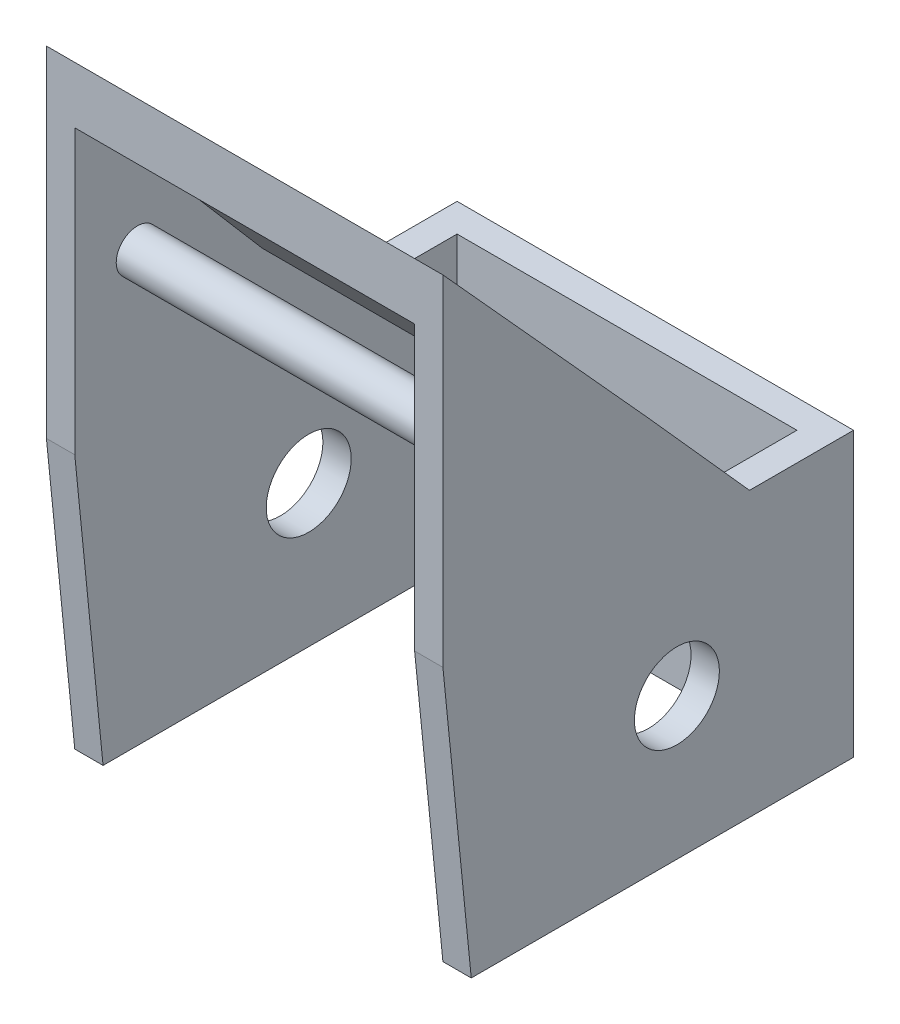
ISO-10303-21;
HEADER;
FILE_DESCRIPTION(('STEP AP214'),'2;1');
FILE_NAME('part.step','',(''),(''),'','','');
FILE_SCHEMA(('AUTOMOTIVE_DESIGN { 1 0 10303 214 1 1 1 1 }'));
ENDSEC;
DATA;
#1=APPLICATION_CONTEXT('core data for automotive mechanical design processes');
#2=APPLICATION_PROTOCOL_DEFINITION('international standard','automotive_design',2000,#1);
#3=PRODUCT_CONTEXT('',#1,'mechanical');
#4=PRODUCT('Part','Part','',(#3));
#5=PRODUCT_RELATED_PRODUCT_CATEGORY('part','',(#4));
#6=PRODUCT_DEFINITION_FORMATION('','',#4);
#7=PRODUCT_DEFINITION_CONTEXT('part definition',#1,'design');
#8=PRODUCT_DEFINITION('design','',#6,#7);
#9=PRODUCT_DEFINITION_SHAPE('','',#8);
#10=(LENGTH_UNIT() NAMED_UNIT(*) SI_UNIT(.MILLI.,.METRE.));
#11=(NAMED_UNIT(*) PLANE_ANGLE_UNIT() SI_UNIT($,.RADIAN.));
#12=(NAMED_UNIT(*) SI_UNIT($,.STERADIAN.) SOLID_ANGLE_UNIT());
#13=UNCERTAINTY_MEASURE_WITH_UNIT(LENGTH_MEASURE(1.E-05),#10,'distance_accuracy_value','');
#14=(GEOMETRIC_REPRESENTATION_CONTEXT(3) GLOBAL_UNCERTAINTY_ASSIGNED_CONTEXT((#13)) GLOBAL_UNIT_ASSIGNED_CONTEXT((#10,
#11,#12)) REPRESENTATION_CONTEXT('',''));
#15=CARTESIAN_POINT('',(0.,0.,0.));
#16=DIRECTION('',(0.,0.,1.));
#17=DIRECTION('',(1.,0.,0.));
#18=AXIS2_PLACEMENT_3D('',#15,#16,#17);
#19=CARTESIAN_POINT('',(70.,70.,70.1575307454289));
#20=DIRECTION('',(0.,0.651008649949704,-0.759070311427514));
#21=DIRECTION('',(0.,0.759070311427514,0.651008649949704));
#22=AXIS2_PLACEMENT_3D('',#19,#20,#21);
#23=PLANE('',#22);
#24=DIRECTION('',(1.,0.,0.));
#25=VECTOR('',#24,1.);
#26=CARTESIAN_POINT('',(0.,80.,78.7339253184877));
#27=LINE('',#26,#25);
#28=CARTESIAN_POINT('',(-60.,80.,78.7339253184877));
#29=VERTEX_POINT('',#28);
#30=CARTESIAN_POINT('',(60.0000000000001,80.,78.7339253184877));
#31=VERTEX_POINT('',#30);
#32=EDGE_CURVE('E180',#29,#31,#27,.T.);
#33=ORIENTED_EDGE('',*,*,#32,.T.);
#34=DIRECTION('',(0.,0.759070311427514,0.651008649949704));
#35=VECTOR('',#34,1.);
#36=CARTESIAN_POINT('',(60.0000000000001,70.,70.1575307454289));
#37=LINE('',#36,#35);
#38=CARTESIAN_POINT('',(60.0000000000001,145.605744001403,135.));
#39=VERTEX_POINT('',#38);
#40=EDGE_CURVE('E166',#31,#39,#37,.T.);
#41=ORIENTED_EDGE('',*,*,#40,.T.);
#42=DIRECTION('',(-1.,0.,0.));
#43=VECTOR('',#42,1.);
#44=CARTESIAN_POINT('',(70.,145.605744001403,135.));
#45=LINE('',#44,#43);
#46=CARTESIAN_POINT('',(-60.,145.605744001403,135.));
#47=VERTEX_POINT('',#46);
#48=EDGE_CURVE('E182',#39,#47,#45,.T.);
#49=ORIENTED_EDGE('',*,*,#48,.T.);
#50=DIRECTION('',(0.,-0.759070311427514,-0.651008649949704));
#51=VECTOR('',#50,1.);
#52=CARTESIAN_POINT('',(-60.,70.,70.1575307454289));
#53=LINE('',#52,#51);
#54=EDGE_CURVE('E178',#47,#29,#53,.T.);
#55=ORIENTED_EDGE('',*,*,#54,.T.);
#56=EDGE_LOOP('',(#33,#41,#49,#55));
#57=FACE_BOUND('',#56,.T.);
#58=ADVANCED_FACE('F33',(#57),#23,.F.);
#59=CARTESIAN_POINT('',(0.,80.,0.));
#60=DIRECTION('',(0.,-1.,0.));
#61=DIRECTION('',(1.,0.,0.));
#62=AXIS2_PLACEMENT_3D('',#59,#60,#61);
#63=PLANE('',#62);
#64=ORIENTED_EDGE('',*,*,#32,.F.);
#65=DIRECTION('',(0.,0.,-1.));
#66=VECTOR('',#65,1.);
#67=CARTESIAN_POINT('',(-60.,80.,145.));
#68=LINE('',#67,#66);
#69=CARTESIAN_POINT('',(-60.,80.,63.5629784970716));
#70=VERTEX_POINT('',#69);
#71=EDGE_CURVE('E48',#29,#70,#68,.T.);
#72=ORIENTED_EDGE('',*,*,#71,.T.);
#73=DIRECTION('',(-1.,0.,0.));
#74=VECTOR('',#73,1.);
#75=CARTESIAN_POINT('',(70.,80.,63.5629784970716));
#76=LINE('',#75,#74);
#77=CARTESIAN_POINT('',(60.,80.,63.5629784970716));
#78=VERTEX_POINT('',#77);
#79=EDGE_CURVE('E187',#78,#70,#76,.T.);
#80=ORIENTED_EDGE('',*,*,#79,.F.);
#81=DIRECTION('',(0.,0.,1.));
#82=VECTOR('',#81,1.);
#83=CARTESIAN_POINT('',(60.,80.,145.));
#84=LINE('',#83,#82);
#85=EDGE_CURVE('E171',#78,#31,#84,.T.);
#86=ORIENTED_EDGE('',*,*,#85,.T.);
#87=EDGE_LOOP('',(#64,#72,#80,#86));
#88=FACE_BOUND('',#87,.T.);
#89=ADVANCED_FACE('F185',(#88),#63,.T.);
#90=CARTESIAN_POINT('',(-70.,50.,10.));
#91=DIRECTION('',(0.,-1.,0.));
#92=DIRECTION('',(0.,0.,-1.));
#93=AXIS2_PLACEMENT_3D('',#90,#91,#92);
#94=PLANE('',#93);
#95=DIRECTION('',(-1.,0.,0.));
#96=VECTOR('',#95,1.);
#97=CARTESIAN_POINT('',(70.,50.,36.7519139882866));
#98=LINE('',#97,#96);
#99=CARTESIAN_POINT('',(70.,50.,36.7519139882866));
#100=VERTEX_POINT('',#99);
#101=CARTESIAN_POINT('',(60.,50.,36.7519139882866));
#102=VERTEX_POINT('',#101);
#103=EDGE_CURVE('E56',#100,#102,#98,.T.);
#104=ORIENTED_EDGE('',*,*,#103,.F.);
#105=DIRECTION('',(0.,0.,-1.));
#106=VECTOR('',#105,1.);
#107=CARTESIAN_POINT('',(70.,50.,10.));
#108=LINE('',#107,#106);
#109=CARTESIAN_POINT('',(70.,50.,0.));
#110=VERTEX_POINT('',#109);
#111=EDGE_CURVE('E298',#100,#110,#108,.T.);
#112=ORIENTED_EDGE('',*,*,#111,.T.);
#113=DIRECTION('',(-1.,0.,0.));
#114=VECTOR('',#113,1.);
#115=CARTESIAN_POINT('',(-70.,50.,0.));
#116=LINE('',#115,#114);
#117=CARTESIAN_POINT('',(-70.,50.,0.));
#118=VERTEX_POINT('',#117);
#119=EDGE_CURVE('E285',#110,#118,#116,.T.);
#120=ORIENTED_EDGE('',*,*,#119,.T.);
#121=DIRECTION('',(0.,0.,-1.));
#122=VECTOR('',#121,1.);
#123=CARTESIAN_POINT('',(-70.,50.,10.));
#124=LINE('',#123,#122);
#125=CARTESIAN_POINT('',(-70.,50.,36.7519139882866));
#126=VERTEX_POINT('',#125);
#127=EDGE_CURVE('E296',#126,#118,#124,.T.);
#128=ORIENTED_EDGE('',*,*,#127,.F.);
#129=CARTESIAN_POINT('',(-60.,50.,36.7519139882866));
#130=VERTEX_POINT('',#129);
#131=EDGE_CURVE('E231',#130,#126,#98,.T.);
#132=ORIENTED_EDGE('',*,*,#131,.F.);
#133=DIRECTION('',(0.,0.,-1.));
#134=VECTOR('',#133,1.);
#135=CARTESIAN_POINT('',(-60.,50.,130.));
#136=LINE('',#135,#134);
#137=CARTESIAN_POINT('',(-60.,50.,10.));
#138=VERTEX_POINT('',#137);
#139=EDGE_CURVE('E260',#130,#138,#136,.T.);
#140=ORIENTED_EDGE('',*,*,#139,.T.);
#141=DIRECTION('',(-1.,0.,0.));
#142=VECTOR('',#141,1.);
#143=CARTESIAN_POINT('',(-70.,50.,10.));
#144=LINE('',#143,#142);
#145=CARTESIAN_POINT('',(60.0000000000001,50.,10.));
#146=VERTEX_POINT('',#145);
#147=EDGE_CURVE('E276',#146,#138,#144,.T.);
#148=ORIENTED_EDGE('',*,*,#147,.F.);
#149=DIRECTION('',(0.,0.,-1.));
#150=VECTOR('',#149,1.);
#151=CARTESIAN_POINT('',(60.,50.,130.));
#152=LINE('',#151,#150);
#153=EDGE_CURVE('E272',#102,#146,#152,.T.);
#154=ORIENTED_EDGE('',*,*,#153,.F.);
#155=EDGE_LOOP('',(#104,#112,#120,#128,#132,#140,#148,#154));
#156=FACE_BOUND('',#155,.T.);
#157=ADVANCED_FACE('F342',(#156),#94,.F.);
#158=CARTESIAN_POINT('',(0.,0.,10.));
#159=DIRECTION('',(0.,0.,1.));
#160=DIRECTION('',(1.,0.,0.));
#161=AXIS2_PLACEMENT_3D('',#158,#159,#160);
#162=PLANE('',#161);
#163=CARTESIAN_POINT('',(0.,0.,10.));
#164=DIRECTION('',(0.,0.,1.));
#165=DIRECTION('',(1.,0.,0.));
#166=AXIS2_PLACEMENT_3D('',#163,#164,#165);
#167=CIRCLE('',#166,15.);
#168=CARTESIAN_POINT('',(15.,0.,10.));
#169=VERTEX_POINT('',#168);
#170=EDGE_CURVE('E308',#169,#169,#167,.T.);
#171=ORIENTED_EDGE('',*,*,#170,.F.);
#172=EDGE_LOOP('',(#171));
#173=FACE_BOUND('',#172,.T.);
#174=ORIENTED_EDGE('',*,*,#147,.T.);
#175=DIRECTION('',(0.,1.,0.));
#176=VECTOR('',#175,1.);
#177=CARTESIAN_POINT('',(-60.,50.,10.));
#178=LINE('',#177,#176);
#179=CARTESIAN_POINT('',(-60.,-50.,10.));
#180=VERTEX_POINT('',#179);
#181=EDGE_CURVE('E255',#180,#138,#178,.T.);
#182=ORIENTED_EDGE('',*,*,#181,.F.);
#183=DIRECTION('',(1.,0.,0.));
#184=VECTOR('',#183,1.);
#185=CARTESIAN_POINT('',(-70.,-50.,10.));
#186=LINE('',#185,#184);
#187=CARTESIAN_POINT('',(60.0000000000001,-50.,10.));
#188=VERTEX_POINT('',#187);
#189=EDGE_CURVE('E279',#180,#188,#186,.T.);
#190=ORIENTED_EDGE('',*,*,#189,.T.);
#191=DIRECTION('',(0.,-1.,0.));
#192=VECTOR('',#191,1.);
#193=CARTESIAN_POINT('',(60.,50.,10.));
#194=LINE('',#193,#192);
#195=EDGE_CURVE('E266',#146,#188,#194,.T.);
#196=ORIENTED_EDGE('',*,*,#195,.F.);
#197=EDGE_LOOP('',(#174,#182,#190,#196));
#198=FACE_BOUND('',#197,.T.);
#199=ADVANCED_FACE('F346',(#173,#198),#162,.T.);
#200=CARTESIAN_POINT('',(70.,50.,10.));
#201=DIRECTION('',(-1.,0.,0.));
#202=DIRECTION('',(0.,-1.,0.));
#203=AXIS2_PLACEMENT_3D('',#200,#201,#202);
#204=PLANE('',#203);
#205=CARTESIAN_POINT('',(70.,0.,62.3874398391209));
#206=DIRECTION('',(-1.,0.,0.));
#207=DIRECTION('',(0.,-1.,0.));
#208=AXIS2_PLACEMENT_3D('',#205,#206,#207);
#209=CIRCLE('',#208,15.);
#210=CARTESIAN_POINT('',(70.,-15.,62.3874398391209));
#211=VERTEX_POINT('',#210);
#212=EDGE_CURVE('E198',#211,#211,#209,.T.);
#213=ORIENTED_EDGE('',*,*,#212,.T.);
#214=EDGE_LOOP('',(#213));
#215=FACE_BOUND('',#214,.T.);
#216=DIRECTION('',(0.,1.,0.));
#217=VECTOR('',#216,1.);
#218=CARTESIAN_POINT('',(70.,50.,0.));
#219=LINE('',#218,#217);
#220=CARTESIAN_POINT('',(70.,-50.,0.));
#221=VERTEX_POINT('',#220);
#222=EDGE_CURVE('E275',#221,#110,#219,.T.);
#223=ORIENTED_EDGE('',*,*,#222,.T.);
#224=ORIENTED_EDGE('',*,*,#111,.F.);
#225=DIRECTION('',(0.,-0.74562456234441,-0.666366274678354));
#226=VECTOR('',#225,1.);
#227=CARTESIAN_POINT('',(70.,90.,72.5));
#228=LINE('',#227,#226);
#229=CARTESIAN_POINT('',(70.,90.,72.5));
#230=VERTEX_POINT('',#229);
#231=EDGE_CURVE('E217',#230,#100,#228,.T.);
#232=ORIENTED_EDGE('',*,*,#231,.F.);
#233=DIRECTION('',(0.,-0.740986951435983,-0.671519424738859));
#234=VECTOR('',#233,1.);
#235=CARTESIAN_POINT('',(70.,90.,72.5));
#236=LINE('',#235,#234);
#237=CARTESIAN_POINT('',(70.,170.,145.));
#238=VERTEX_POINT('',#237);
#239=EDGE_CURVE('E213',#238,#230,#236,.T.);
#240=ORIENTED_EDGE('',*,*,#239,.F.);
#241=DIRECTION('',(0.,1.,0.));
#242=VECTOR('',#241,1.);
#243=CARTESIAN_POINT('',(70.,170.,145.));
#244=LINE('',#243,#242);
#245=CARTESIAN_POINT('',(70.,50.,145.));
#246=VERTEX_POINT('',#245);
#247=EDGE_CURVE('E210',#246,#238,#244,.T.);
#248=ORIENTED_EDGE('',*,*,#247,.F.);
#249=DIRECTION('',(0.,-0.995037190209989,-0.0995037190209987));
#250=VECTOR('',#249,1.);
#251=CARTESIAN_POINT('',(70.,50.,145.));
#252=LINE('',#251,#250);
#253=CARTESIAN_POINT('',(70.,-50.,135.));
#254=VERTEX_POINT('',#253);
#255=EDGE_CURVE('E229',#246,#254,#252,.T.);
#256=ORIENTED_EDGE('',*,*,#255,.T.);
#257=DIRECTION('',(0.,0.,-1.));
#258=VECTOR('',#257,1.);
#259=CARTESIAN_POINT('',(70.,-50.,10.));
#260=LINE('',#259,#258);
#261=EDGE_CURVE('E282',#254,#221,#260,.T.);
#262=ORIENTED_EDGE('',*,*,#261,.T.);
#263=EDGE_LOOP('',(#223,#224,#232,#240,#248,#256,#262));
#264=FACE_BOUND('',#263,.T.);
#265=ADVANCED_FACE('F35',(#215,#264),#204,.F.);
#266=CARTESIAN_POINT('',(-70.,50.,10.));
#267=DIRECTION('',(1.,0.,0.));
#268=DIRECTION('',(0.,1.,0.));
#269=AXIS2_PLACEMENT_3D('',#266,#267,#268);
#270=PLANE('',#269);
#271=CARTESIAN_POINT('',(-70.,0.,62.3874398391209));
#272=DIRECTION('',(-1.,0.,0.));
#273=DIRECTION('',(0.,-1.,0.));
#274=AXIS2_PLACEMENT_3D('',#271,#272,#273);
#275=CIRCLE('',#274,15.);
#276=CARTESIAN_POINT('',(-70.,-15.,62.3874398391209));
#277=VERTEX_POINT('',#276);
#278=EDGE_CURVE('E305',#277,#277,#275,.T.);
#279=ORIENTED_EDGE('',*,*,#278,.F.);
#280=EDGE_LOOP('',(#279));
#281=FACE_BOUND('',#280,.T.);
#282=DIRECTION('',(0.,-1.,0.));
#283=VECTOR('',#282,1.);
#284=CARTESIAN_POINT('',(-70.,50.,0.));
#285=LINE('',#284,#283);
#286=CARTESIAN_POINT('',(-70.,-50.,0.));
#287=VERTEX_POINT('',#286);
#288=EDGE_CURVE('E288',#118,#287,#285,.T.);
#289=ORIENTED_EDGE('',*,*,#288,.T.);
#290=DIRECTION('',(0.,0.,-1.));
#291=VECTOR('',#290,1.);
#292=CARTESIAN_POINT('',(-70.,-50.,10.));
#293=LINE('',#292,#291);
#294=CARTESIAN_POINT('',(-70.,-50.,135.));
#295=VERTEX_POINT('',#294);
#296=EDGE_CURVE('E293',#295,#287,#293,.T.);
#297=ORIENTED_EDGE('',*,*,#296,.F.);
#298=DIRECTION('',(0.,0.995037190209989,0.0995037190209987));
#299=VECTOR('',#298,1.);
#300=CARTESIAN_POINT('',(-70.,50.,145.));
#301=LINE('',#300,#299);
#302=CARTESIAN_POINT('',(-70.,50.,145.));
#303=VERTEX_POINT('',#302);
#304=EDGE_CURVE('E244',#295,#303,#301,.T.);
#305=ORIENTED_EDGE('',*,*,#304,.T.);
#306=DIRECTION('',(0.,1.,0.));
#307=VECTOR('',#306,1.);
#308=CARTESIAN_POINT('',(-70.,170.,145.));
#309=LINE('',#308,#307);
#310=CARTESIAN_POINT('',(-70.,170.,145.));
#311=VERTEX_POINT('',#310);
#312=EDGE_CURVE('E209',#303,#311,#309,.T.);
#313=ORIENTED_EDGE('',*,*,#312,.T.);
#314=DIRECTION('',(0.,-0.740986951435983,-0.671519424738859));
#315=VECTOR('',#314,1.);
#316=CARTESIAN_POINT('',(-70.,90.,72.5));
#317=LINE('',#316,#315);
#318=CARTESIAN_POINT('',(-70.,90.,72.5));
#319=VERTEX_POINT('',#318);
#320=EDGE_CURVE('E223',#311,#319,#317,.T.);
#321=ORIENTED_EDGE('',*,*,#320,.T.);
#322=DIRECTION('',(0.,-0.74562456234441,-0.666366274678354));
#323=VECTOR('',#322,1.);
#324=CARTESIAN_POINT('',(-70.,90.,72.5));
#325=LINE('',#324,#323);
#326=EDGE_CURVE('E214',#319,#126,#325,.T.);
#327=ORIENTED_EDGE('',*,*,#326,.T.);
#328=ORIENTED_EDGE('',*,*,#127,.T.);
#329=EDGE_LOOP('',(#289,#297,#305,#313,#321,#327,#328));
#330=FACE_BOUND('',#329,.T.);
#331=ADVANCED_FACE('F357',(#281,#330),#270,.F.);
#332=CARTESIAN_POINT('',(-70.,-50.,10.));
#333=DIRECTION('',(0.,1.,0.));
#334=DIRECTION('',(0.,0.,1.));
#335=AXIS2_PLACEMENT_3D('',#332,#333,#334);
#336=PLANE('',#335);
#337=DIRECTION('',(1.,0.,0.));
#338=VECTOR('',#337,1.);
#339=CARTESIAN_POINT('',(-70.,-50.,0.));
#340=LINE('',#339,#338);
#341=EDGE_CURVE('E280',#287,#221,#340,.T.);
#342=ORIENTED_EDGE('',*,*,#341,.T.);
#343=ORIENTED_EDGE('',*,*,#261,.F.);
#344=DIRECTION('',(1.,0.,0.));
#345=VECTOR('',#344,1.);
#346=CARTESIAN_POINT('',(60.0000000000001,-50.,135.));
#347=LINE('',#346,#345);
#348=CARTESIAN_POINT('',(60.0000000000001,-50.,135.));
#349=VERTEX_POINT('',#348);
#350=EDGE_CURVE('E241',#349,#254,#347,.T.);
#351=ORIENTED_EDGE('',*,*,#350,.F.);
#352=DIRECTION('',(0.,0.,-1.));
#353=VECTOR('',#352,1.);
#354=CARTESIAN_POINT('',(60.0000000000001,-50.,130.));
#355=LINE('',#354,#353);
#356=EDGE_CURVE('E269',#349,#188,#355,.T.);
#357=ORIENTED_EDGE('',*,*,#356,.T.);
#358=ORIENTED_EDGE('',*,*,#189,.F.);
#359=DIRECTION('',(0.,0.,-1.));
#360=VECTOR('',#359,1.);
#361=CARTESIAN_POINT('',(-60.,-50.,130.));
#362=LINE('',#361,#360);
#363=CARTESIAN_POINT('',(-60.,-50.,135.));
#364=VERTEX_POINT('',#363);
#365=EDGE_CURVE('E263',#364,#180,#362,.T.);
#366=ORIENTED_EDGE('',*,*,#365,.F.);
#367=DIRECTION('',(-1.,0.,0.));
#368=VECTOR('',#367,1.);
#369=CARTESIAN_POINT('',(-60.,-50.,135.));
#370=LINE('',#369,#368);
#371=EDGE_CURVE('E250',#364,#295,#370,.T.);
#372=ORIENTED_EDGE('',*,*,#371,.T.);
#373=ORIENTED_EDGE('',*,*,#296,.T.);
#374=EDGE_LOOP('',(#342,#343,#351,#357,#358,#366,#372,#373));
#375=FACE_BOUND('',#374,.T.);
#376=ADVANCED_FACE('F351',(#375),#336,.F.);
#377=CARTESIAN_POINT('',(0.,0.,0.));
#378=DIRECTION('',(0.,0.,1.));
#379=DIRECTION('',(1.,0.,0.));
#380=AXIS2_PLACEMENT_3D('',#377,#378,#379);
#381=PLANE('',#380);
#382=CARTESIAN_POINT('',(0.,0.,0.));
#383=DIRECTION('',(0.,0.,1.));
#384=DIRECTION('',(1.,0.,0.));
#385=AXIS2_PLACEMENT_3D('',#382,#383,#384);
#386=CIRCLE('',#385,15.);
#387=CARTESIAN_POINT('',(15.,0.,0.));
#388=VERTEX_POINT('',#387);
#389=EDGE_CURVE('E306',#388,#388,#386,.T.);
#390=ORIENTED_EDGE('',*,*,#389,.T.);
#391=EDGE_LOOP('',(#390));
#392=FACE_BOUND('',#391,.T.);
#393=ORIENTED_EDGE('',*,*,#222,.F.);
#394=ORIENTED_EDGE('',*,*,#341,.F.);
#395=ORIENTED_EDGE('',*,*,#288,.F.);
#396=ORIENTED_EDGE('',*,*,#119,.F.);
#397=EDGE_LOOP('',(#393,#394,#395,#396));
#398=FACE_BOUND('',#397,.T.);
#399=ADVANCED_FACE('F372',(#392,#398),#381,.F.);
#400=CARTESIAN_POINT('',(60.,50.,130.));
#401=DIRECTION('',(1.,0.,0.));
#402=DIRECTION('',(0.,1.,0.));
#403=AXIS2_PLACEMENT_3D('',#400,#401,#402);
#404=PLANE('',#403);
#405=CARTESIAN_POINT('',(60.,101.432424940226,122.863088973279));
#406=DIRECTION('',(1.,0.,0.));
#407=DIRECTION('',(0.,1.,0.));
#408=AXIS2_PLACEMENT_3D('',#405,#406,#407);
#409=CIRCLE('',#408,7.50000000000001);
#410=CARTESIAN_POINT('',(60.,108.932424940227,122.863088973279));
#411=VERTEX_POINT('',#410);
#412=EDGE_CURVE('E11',#411,#411,#409,.F.);
#413=ORIENTED_EDGE('',*,*,#412,.F.);
#414=EDGE_LOOP('',(#413));
#415=FACE_BOUND('',#414,.T.);
#416=ORIENTED_EDGE('',*,*,#40,.F.);
#417=ORIENTED_EDGE('',*,*,#85,.F.);
#418=DIRECTION('',(0.,-0.74562456234441,-0.666366274678354));
#419=VECTOR('',#418,1.);
#420=CARTESIAN_POINT('',(60.,90.,72.5));
#421=LINE('',#420,#419);
#422=CARTESIAN_POINT('',(60.,60.9064439346687,46.4990263847482));
#423=VERTEX_POINT('',#422);
#424=EDGE_CURVE('E205',#78,#423,#421,.T.);
#425=ORIENTED_EDGE('',*,*,#424,.T.);
#426=DIRECTION('',(0.,-1.,0.));
#427=VECTOR('',#426,1.);
#428=CARTESIAN_POINT('',(60.,80.,46.4990263847482));
#429=LINE('',#428,#427);
#430=CARTESIAN_POINT('',(60.,50.,46.4990263847482));
#431=VERTEX_POINT('',#430);
#432=EDGE_CURVE('E190',#423,#431,#429,.T.);
#433=ORIENTED_EDGE('',*,*,#432,.T.);
#434=EDGE_CURVE('E273',#431,#102,#152,.T.);
#435=ORIENTED_EDGE('',*,*,#434,.T.);
#436=ORIENTED_EDGE('',*,*,#153,.T.);
#437=ORIENTED_EDGE('',*,*,#195,.T.);
#438=ORIENTED_EDGE('',*,*,#356,.F.);
#439=DIRECTION('',(0.,-0.995037190209989,-0.0995037190209987));
#440=VECTOR('',#439,1.);
#441=CARTESIAN_POINT('',(60.,50.,145.));
#442=LINE('',#441,#440);
#443=CARTESIAN_POINT('',(60.,50.,145.));
#444=VERTEX_POINT('',#443);
#445=EDGE_CURVE('E235',#444,#349,#442,.T.);
#446=ORIENTED_EDGE('',*,*,#445,.F.);
#447=DIRECTION('',(0.,-1.,0.));
#448=VECTOR('',#447,1.);
#449=CARTESIAN_POINT('',(60.,80.,145.));
#450=LINE('',#449,#448);
#451=CARTESIAN_POINT('',(60.,150.,145.));
#452=VERTEX_POINT('',#451);
#453=EDGE_CURVE('E201',#452,#444,#450,.T.);
#454=ORIENTED_EDGE('',*,*,#453,.F.);
#455=DIRECTION('',(0.,0.,1.));
#456=VECTOR('',#455,1.);
#457=CARTESIAN_POINT('',(60.,150.,135.));
#458=LINE('',#457,#456);
#459=CARTESIAN_POINT('',(60.,150.,135.));
#460=VERTEX_POINT('',#459);
#461=EDGE_CURVE('E381',#460,#452,#458,.T.);
#462=ORIENTED_EDGE('',*,*,#461,.F.);
#463=DIRECTION('',(0.,1.,0.));
#464=VECTOR('',#463,1.);
#465=CARTESIAN_POINT('',(60.,80.,135.));
#466=LINE('',#465,#464);
#467=EDGE_CURVE('E174',#39,#460,#466,.T.);
#468=ORIENTED_EDGE('',*,*,#467,.F.);
#469=EDGE_LOOP('',(#416,#417,#425,#433,#435,#436,#437,#438,#446,#454,#462,#468));
#470=FACE_BOUND('',#469,.T.);
#471=CARTESIAN_POINT('',(60.,0.,62.3874398391209));
#472=DIRECTION('',(1.,0.,0.));
#473=DIRECTION('',(0.,1.,0.));
#474=AXIS2_PLACEMENT_3D('',#471,#472,#473);
#475=CIRCLE('',#474,15.);
#476=CARTESIAN_POINT('',(60.,15.,62.3874398391209));
#477=VERTEX_POINT('',#476);
#478=EDGE_CURVE('E304',#477,#477,#475,.T.);
#479=ORIENTED_EDGE('',*,*,#478,.T.);
#480=EDGE_LOOP('',(#479));
#481=FACE_BOUND('',#480,.T.);
#482=ADVANCED_FACE('F168',(#415,#470,#481),#404,.F.);
#483=CARTESIAN_POINT('',(-60.,50.,130.));
#484=DIRECTION('',(-1.,0.,0.));
#485=DIRECTION('',(0.,-1.,0.));
#486=AXIS2_PLACEMENT_3D('',#483,#484,#485);
#487=PLANE('',#486);
#488=CARTESIAN_POINT('',(-60.,101.432424940226,122.863088973279));
#489=DIRECTION('',(-1.,0.,0.));
#490=DIRECTION('',(0.,-1.,0.));
#491=AXIS2_PLACEMENT_3D('',#488,#489,#490);
#492=CIRCLE('',#491,7.50000000000001);
#493=CARTESIAN_POINT('',(-60.,93.9324249402265,122.863088973279));
#494=VERTEX_POINT('',#493);
#495=EDGE_CURVE('E41',#494,#494,#492,.F.);
#496=ORIENTED_EDGE('',*,*,#495,.F.);
#497=EDGE_LOOP('',(#496));
#498=FACE_BOUND('',#497,.T.);
#499=CARTESIAN_POINT('',(-60.,0.,62.3874398391209));
#500=DIRECTION('',(-1.,0.,0.));
#501=DIRECTION('',(0.,-1.,0.));
#502=AXIS2_PLACEMENT_3D('',#499,#500,#501);
#503=CIRCLE('',#502,15.);
#504=CARTESIAN_POINT('',(-60.,-15.,62.3874398391209));
#505=VERTEX_POINT('',#504);
#506=EDGE_CURVE('E301',#505,#505,#503,.T.);
#507=ORIENTED_EDGE('',*,*,#506,.T.);
#508=EDGE_LOOP('',(#507));
#509=FACE_BOUND('',#508,.T.);
#510=ORIENTED_EDGE('',*,*,#71,.F.);
#511=ORIENTED_EDGE('',*,*,#54,.F.);
#512=DIRECTION('',(0.,-1.,0.));
#513=VECTOR('',#512,1.);
#514=CARTESIAN_POINT('',(-60.,80.,135.));
#515=LINE('',#514,#513);
#516=CARTESIAN_POINT('',(-60.,150.,135.));
#517=VERTEX_POINT('',#516);
#518=EDGE_CURVE('E393',#517,#47,#515,.T.);
#519=ORIENTED_EDGE('',*,*,#518,.F.);
#520=DIRECTION('',(0.,0.,1.));
#521=VECTOR('',#520,1.);
#522=CARTESIAN_POINT('',(-60.,150.,135.));
#523=LINE('',#522,#521);
#524=CARTESIAN_POINT('',(-60.,150.,145.));
#525=VERTEX_POINT('',#524);
#526=EDGE_CURVE('E390',#517,#525,#523,.T.);
#527=ORIENTED_EDGE('',*,*,#526,.T.);
#528=DIRECTION('',(0.,-1.,0.));
#529=VECTOR('',#528,1.);
#530=CARTESIAN_POINT('',(-60.,80.,145.));
#531=LINE('',#530,#529);
#532=CARTESIAN_POINT('',(-60.,50.,145.));
#533=VERTEX_POINT('',#532);
#534=EDGE_CURVE('E199',#525,#533,#531,.T.);
#535=ORIENTED_EDGE('',*,*,#534,.T.);
#536=DIRECTION('',(0.,0.995037190209989,0.0995037190209987));
#537=VECTOR('',#536,1.);
#538=CARTESIAN_POINT('',(-60.,50.,145.));
#539=LINE('',#538,#537);
#540=EDGE_CURVE('E247',#364,#533,#539,.T.);
#541=ORIENTED_EDGE('',*,*,#540,.F.);
#542=ORIENTED_EDGE('',*,*,#365,.T.);
#543=ORIENTED_EDGE('',*,*,#181,.T.);
#544=ORIENTED_EDGE('',*,*,#139,.F.);
#545=CARTESIAN_POINT('',(-60.,50.,46.4990263847482));
#546=VERTEX_POINT('',#545);
#547=EDGE_CURVE('E261',#546,#130,#136,.T.);
#548=ORIENTED_EDGE('',*,*,#547,.F.);
#549=DIRECTION('',(0.,-1.,0.));
#550=VECTOR('',#549,1.);
#551=CARTESIAN_POINT('',(-60.,80.,46.4990263847482));
#552=LINE('',#551,#550);
#553=CARTESIAN_POINT('',(-60.,60.9064439346687,46.4990263847482));
#554=VERTEX_POINT('',#553);
#555=EDGE_CURVE('E188',#554,#546,#552,.T.);
#556=ORIENTED_EDGE('',*,*,#555,.F.);
#557=DIRECTION('',(0.,0.74562456234441,0.666366274678354));
#558=VECTOR('',#557,1.);
#559=CARTESIAN_POINT('',(-60.,90.,72.5));
#560=LINE('',#559,#558);
#561=EDGE_CURVE('E207',#554,#70,#560,.T.);
#562=ORIENTED_EDGE('',*,*,#561,.T.);
#563=EDGE_LOOP('',(#510,#511,#519,#527,#535,#541,#542,#543,#544,#548,#556,#562));
#564=FACE_BOUND('',#563,.T.);
#565=ADVANCED_FACE('F316',(#498,#509,#564),#487,.F.);
#566=CARTESIAN_POINT('',(-60.,50.,145.));
#567=DIRECTION('',(0.,-0.0995037190209987,0.995037190209989));
#568=DIRECTION('',(0.,-0.995037190209989,-0.0995037190209987));
#569=AXIS2_PLACEMENT_3D('',#566,#567,#568);
#570=PLANE('',#569);
#571=ORIENTED_EDGE('',*,*,#304,.F.);
#572=ORIENTED_EDGE('',*,*,#371,.F.);
#573=ORIENTED_EDGE('',*,*,#540,.T.);
#574=DIRECTION('',(-1.,0.,0.));
#575=VECTOR('',#574,1.);
#576=CARTESIAN_POINT('',(-60.,50.,145.));
#577=LINE('',#576,#575);
#578=EDGE_CURVE('E253',#533,#303,#577,.T.);
#579=ORIENTED_EDGE('',*,*,#578,.T.);
#580=EDGE_LOOP('',(#571,#572,#573,#579));
#581=FACE_BOUND('',#580,.T.);
#582=ADVANCED_FACE('F319',(#581),#570,.T.);
#583=CARTESIAN_POINT('',(60.,50.,145.));
#584=DIRECTION('',(0.,-0.0995037190209987,0.995037190209989));
#585=DIRECTION('',(0.,-0.995037190209989,-0.0995037190209987));
#586=AXIS2_PLACEMENT_3D('',#583,#584,#585);
#587=PLANE('',#586);
#588=ORIENTED_EDGE('',*,*,#255,.F.);
#589=DIRECTION('',(1.,0.,0.));
#590=VECTOR('',#589,1.);
#591=CARTESIAN_POINT('',(60.,50.,145.));
#592=LINE('',#591,#590);
#593=EDGE_CURVE('E238',#444,#246,#592,.T.);
#594=ORIENTED_EDGE('',*,*,#593,.F.);
#595=ORIENTED_EDGE('',*,*,#445,.T.);
#596=ORIENTED_EDGE('',*,*,#350,.T.);
#597=EDGE_LOOP('',(#588,#594,#595,#596));
#598=FACE_BOUND('',#597,.T.);
#599=ADVANCED_FACE('F377',(#598),#587,.T.);
#600=CARTESIAN_POINT('',(70.,50.,145.));
#601=DIRECTION('',(0.,-1.,0.));
#602=DIRECTION('',(1.,0.,0.));
#603=AXIS2_PLACEMENT_3D('',#600,#601,#602);
#604=PLANE('',#603);
#605=DIRECTION('',(1.,0.,0.));
#606=VECTOR('',#605,1.);
#607=CARTESIAN_POINT('',(-60.,50.,46.4990263847482));
#608=LINE('',#607,#606);
#609=EDGE_CURVE('E192',#546,#431,#608,.T.);
#610=ORIENTED_EDGE('',*,*,#609,.F.);
#611=ORIENTED_EDGE('',*,*,#547,.T.);
#612=EDGE_CURVE('E230',#102,#130,#98,.T.);
#613=ORIENTED_EDGE('',*,*,#612,.F.);
#614=ORIENTED_EDGE('',*,*,#434,.F.);
#615=EDGE_LOOP('',(#610,#611,#613,#614));
#616=FACE_BOUND('',#615,.T.);
#617=ADVANCED_FACE('F338',(#616),#604,.T.);
#618=CARTESIAN_POINT('',(70.,90.,72.5));
#619=DIRECTION('',(0.,0.666366274678354,-0.74562456234441));
#620=DIRECTION('',(0.,0.74562456234441,0.666366274678354));
#621=AXIS2_PLACEMENT_3D('',#618,#619,#620);
#622=PLANE('',#621);
#623=DIRECTION('',(-1.,0.,0.));
#624=VECTOR('',#623,1.);
#625=CARTESIAN_POINT('',(70.,60.9064439346687,46.4990263847482));
#626=LINE('',#625,#624);
#627=EDGE_CURVE('E183',#423,#554,#626,.T.);
#628=ORIENTED_EDGE('',*,*,#627,.F.);
#629=ORIENTED_EDGE('',*,*,#424,.F.);
#630=ORIENTED_EDGE('',*,*,#79,.T.);
#631=ORIENTED_EDGE('',*,*,#561,.F.);
#632=EDGE_LOOP('',(#628,#629,#630,#631));
#633=FACE_BOUND('',#632,.T.);
#634=ORIENTED_EDGE('',*,*,#326,.F.);
#635=DIRECTION('',(-1.,0.,0.));
#636=VECTOR('',#635,1.);
#637=CARTESIAN_POINT('',(70.,90.,72.5));
#638=LINE('',#637,#636);
#639=EDGE_CURVE('E232',#230,#319,#638,.T.);
#640=ORIENTED_EDGE('',*,*,#639,.F.);
#641=ORIENTED_EDGE('',*,*,#231,.T.);
#642=ORIENTED_EDGE('',*,*,#103,.T.);
#643=ORIENTED_EDGE('',*,*,#612,.T.);
#644=ORIENTED_EDGE('',*,*,#131,.T.);
#645=EDGE_LOOP('',(#634,#640,#641,#642,#643,#644));
#646=FACE_BOUND('',#645,.T.);
#647=ADVANCED_FACE('F329',(#633,#646),#622,.T.);
#648=CARTESIAN_POINT('',(70.,90.,72.5));
#649=DIRECTION('',(0.,0.671519424738859,-0.740986951435983));
#650=DIRECTION('',(0.,0.740986951435983,0.671519424738859));
#651=AXIS2_PLACEMENT_3D('',#648,#649,#650);
#652=PLANE('',#651);
#653=ORIENTED_EDGE('',*,*,#320,.F.);
#654=DIRECTION('',(-1.,0.,0.));
#655=VECTOR('',#654,1.);
#656=CARTESIAN_POINT('',(70.,170.,145.));
#657=LINE('',#656,#655);
#658=EDGE_CURVE('E220',#238,#311,#657,.T.);
#659=ORIENTED_EDGE('',*,*,#658,.F.);
#660=ORIENTED_EDGE('',*,*,#239,.T.);
#661=ORIENTED_EDGE('',*,*,#639,.T.);
#662=EDGE_LOOP('',(#653,#659,#660,#661));
#663=FACE_BOUND('',#662,.T.);
#664=ADVANCED_FACE('F364',(#663),#652,.T.);
#665=CARTESIAN_POINT('',(70.,170.,145.));
#666=DIRECTION('',(0.,0.,1.));
#667=DIRECTION('',(0.,-1.,0.));
#668=AXIS2_PLACEMENT_3D('',#665,#666,#667);
#669=PLANE('',#668);
#670=ORIENTED_EDGE('',*,*,#534,.F.);
#671=DIRECTION('',(-1.,0.,0.));
#672=VECTOR('',#671,1.);
#673=CARTESIAN_POINT('',(-60.,150.,145.));
#674=LINE('',#673,#672);
#675=EDGE_CURVE('E387',#452,#525,#674,.T.);
#676=ORIENTED_EDGE('',*,*,#675,.F.);
#677=ORIENTED_EDGE('',*,*,#453,.T.);
#678=ORIENTED_EDGE('',*,*,#593,.T.);
#679=ORIENTED_EDGE('',*,*,#247,.T.);
#680=ORIENTED_EDGE('',*,*,#658,.T.);
#681=ORIENTED_EDGE('',*,*,#312,.F.);
#682=ORIENTED_EDGE('',*,*,#578,.F.);
#683=EDGE_LOOP('',(#670,#676,#677,#678,#679,#680,#681,#682));
#684=FACE_BOUND('',#683,.T.);
#685=ADVANCED_FACE('F359',(#684),#669,.T.);
#686=CARTESIAN_POINT('',(-60.,80.,46.4990263847482));
#687=DIRECTION('',(0.,0.,-1.));
#688=DIRECTION('',(-1.,0.,0.));
#689=AXIS2_PLACEMENT_3D('',#686,#687,#688);
#690=PLANE('',#689);
#691=ORIENTED_EDGE('',*,*,#627,.T.);
#692=ORIENTED_EDGE('',*,*,#555,.T.);
#693=ORIENTED_EDGE('',*,*,#609,.T.);
#694=ORIENTED_EDGE('',*,*,#432,.F.);
#695=EDGE_LOOP('',(#691,#692,#693,#694));
#696=FACE_BOUND('',#695,.T.);
#697=ADVANCED_FACE('F333',(#696),#690,.F.);
#698=CARTESIAN_POINT('',(100.,0.,62.3874398391209));
#699=DIRECTION('',(-1.,0.,0.));
#700=DIRECTION('',(0.,-1.,0.));
#701=AXIS2_PLACEMENT_3D('',#698,#699,#700);
#702=CYLINDRICAL_SURFACE('',#701,15.);
#703=ORIENTED_EDGE('',*,*,#278,.T.);
#704=EDGE_LOOP('',(#703));
#705=FACE_BOUND('',#704,.T.);
#706=ORIENTED_EDGE('',*,*,#506,.F.);
#707=EDGE_LOOP('',(#706));
#708=FACE_BOUND('',#707,.T.);
#709=ADVANCED_FACE('F413',(#705,#708),#702,.F.);
#710=ORIENTED_EDGE('',*,*,#478,.F.);
#711=EDGE_LOOP('',(#710));
#712=FACE_BOUND('',#711,.T.);
#713=ORIENTED_EDGE('',*,*,#212,.F.);
#714=EDGE_LOOP('',(#713));
#715=FACE_BOUND('',#714,.T.);
#716=ADVANCED_FACE('F410',(#712,#715),#702,.F.);
#717=CARTESIAN_POINT('',(0.,0.,-160.));
#718=DIRECTION('',(0.,0.,1.));
#719=DIRECTION('',(1.,0.,0.));
#720=AXIS2_PLACEMENT_3D('',#717,#718,#719);
#721=CYLINDRICAL_SURFACE('',#720,15.);
#722=ORIENTED_EDGE('',*,*,#170,.T.);
#723=EDGE_LOOP('',(#722));
#724=FACE_BOUND('',#723,.T.);
#725=ORIENTED_EDGE('',*,*,#389,.F.);
#726=EDGE_LOOP('',(#725));
#727=FACE_BOUND('',#726,.T.);
#728=ADVANCED_FACE('F412',(#724,#727),#721,.F.);
#729=CARTESIAN_POINT('',(0.,0.,135.));
#730=DIRECTION('',(0.,0.,-1.));
#731=DIRECTION('',(-1.,0.,0.));
#732=AXIS2_PLACEMENT_3D('',#729,#730,#731);
#733=PLANE('',#732);
#734=ORIENTED_EDGE('',*,*,#467,.T.);
#735=DIRECTION('',(-1.,0.,0.));
#736=VECTOR('',#735,1.);
#737=CARTESIAN_POINT('',(-60.,150.,135.));
#738=LINE('',#737,#736);
#739=EDGE_CURVE('E389',#460,#517,#738,.T.);
#740=ORIENTED_EDGE('',*,*,#739,.T.);
#741=ORIENTED_EDGE('',*,*,#518,.T.);
#742=ORIENTED_EDGE('',*,*,#48,.F.);
#743=EDGE_LOOP('',(#734,#740,#741,#742));
#744=FACE_BOUND('',#743,.T.);
#745=ADVANCED_FACE('F420',(#744),#733,.F.);
#746=CARTESIAN_POINT('',(-60.,150.,135.));
#747=DIRECTION('',(0.,1.,0.));
#748=DIRECTION('',(0.,0.,1.));
#749=AXIS2_PLACEMENT_3D('',#746,#747,#748);
#750=PLANE('',#749);
#751=ORIENTED_EDGE('',*,*,#675,.T.);
#752=ORIENTED_EDGE('',*,*,#526,.F.);
#753=ORIENTED_EDGE('',*,*,#739,.F.);
#754=ORIENTED_EDGE('',*,*,#461,.T.);
#755=EDGE_LOOP('',(#751,#752,#753,#754));
#756=FACE_BOUND('',#755,.T.);
#757=ADVANCED_FACE('F386',(#756),#750,.F.);
#758=CARTESIAN_POINT('',(-59.9999999999999,101.432424940226,122.863088973279));
#759=DIRECTION('',(1.,0.,0.));
#760=DIRECTION('',(0.,1.,0.));
#761=AXIS2_PLACEMENT_3D('',#758,#759,#760);
#762=CYLINDRICAL_SURFACE('',#761,7.50000000000001);
#763=ORIENTED_EDGE('',*,*,#495,.T.);
#764=EDGE_LOOP('',(#763));
#765=FACE_BOUND('',#764,.T.);
#766=ORIENTED_EDGE('',*,*,#412,.T.);
#767=EDGE_LOOP('',(#766));
#768=FACE_BOUND('',#767,.T.);
#769=ADVANCED_FACE('F313',(#765,#768),#762,.T.);
#770=CLOSED_SHELL('',(#58,#89,#157,#199,#265,#331,#376,#399,#482,#565,#582,#599,#617,#647,#664,
#685,#697,#709,#716,#728,#745,#757,#769));
#771=MANIFOLD_SOLID_BREP('B2',#770);
#772=ADVANCED_BREP_SHAPE_REPRESENTATION('',(#18,#771),#14);
#773=SHAPE_DEFINITION_REPRESENTATION(#9,#772);
ENDSEC;
END-ISO-10303-21;
